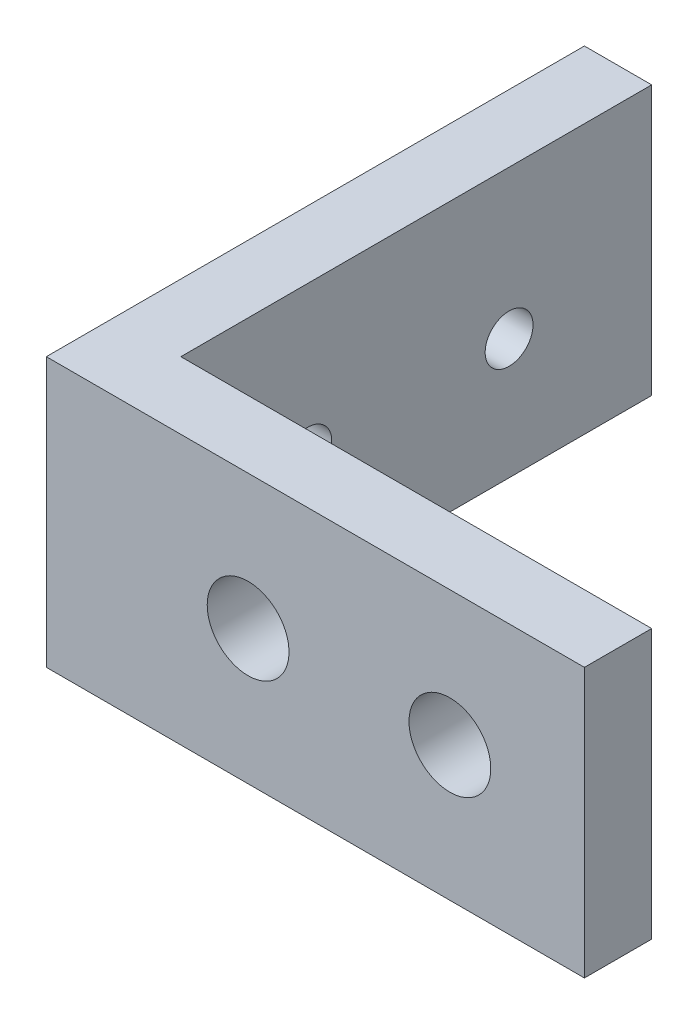
ISO-10303-21;
HEADER;
FILE_DESCRIPTION(('STEP AP214'),'2;1');
FILE_NAME('part.step','',(''),(''),'','','');
FILE_SCHEMA(('AUTOMOTIVE_DESIGN { 1 0 10303 214 1 1 1 1 }'));
ENDSEC;
DATA;
#1=APPLICATION_CONTEXT('core data for automotive mechanical design processes');
#2=APPLICATION_PROTOCOL_DEFINITION('international standard','automotive_design',2000,#1);
#3=PRODUCT_CONTEXT('',#1,'mechanical');
#4=PRODUCT('Part','Part','',(#3));
#5=PRODUCT_RELATED_PRODUCT_CATEGORY('part','',(#4));
#6=PRODUCT_DEFINITION_FORMATION('','',#4);
#7=PRODUCT_DEFINITION_CONTEXT('part definition',#1,'design');
#8=PRODUCT_DEFINITION('design','',#6,#7);
#9=PRODUCT_DEFINITION_SHAPE('','',#8);
#10=(LENGTH_UNIT() NAMED_UNIT(*) SI_UNIT(.MILLI.,.METRE.));
#11=(NAMED_UNIT(*) PLANE_ANGLE_UNIT() SI_UNIT($,.RADIAN.));
#12=(NAMED_UNIT(*) SI_UNIT($,.STERADIAN.) SOLID_ANGLE_UNIT());
#13=UNCERTAINTY_MEASURE_WITH_UNIT(LENGTH_MEASURE(1.E-05),#10,'distance_accuracy_value','');
#14=(GEOMETRIC_REPRESENTATION_CONTEXT(3) GLOBAL_UNCERTAINTY_ASSIGNED_CONTEXT((#13)) GLOBAL_UNIT_ASSIGNED_CONTEXT((#10,
#11,#12)) REPRESENTATION_CONTEXT('',''));
#15=CARTESIAN_POINT('',(0.,0.,0.));
#16=DIRECTION('',(0.,0.,1.));
#17=DIRECTION('',(1.,0.,0.));
#18=AXIS2_PLACEMENT_3D('',#15,#16,#17);
#19=CARTESIAN_POINT('',(-12.7,12.7,12.7));
#20=DIRECTION('',(1.,0.,0.));
#21=DIRECTION('',(0.,0.,-1.));
#22=AXIS2_PLACEMENT_3D('',#19,#20,#21);
#23=PLANE('',#22);
#24=CARTESIAN_POINT('',(-12.7,5.6896,-5.969));
#25=DIRECTION('',(-1.,0.,0.));
#26=DIRECTION('',(0.,0.,1.));
#27=AXIS2_PLACEMENT_3D('',#24,#25,#26);
#28=CIRCLE('',#27,1.13029999999999);
#29=CARTESIAN_POINT('',(-12.7,5.6896,-4.83870000000001));
#30=VERTEX_POINT('',#29);
#31=EDGE_CURVE('E151',#30,#30,#28,.T.);
#32=ORIENTED_EDGE('',*,*,#31,.F.);
#33=EDGE_LOOP('',(#32));
#34=FACE_BOUND('',#33,.T.);
#35=CARTESIAN_POINT('',(-12.7,5.6896,3.5306));
#36=DIRECTION('',(-1.,0.,0.));
#37=DIRECTION('',(0.,0.,1.));
#38=AXIS2_PLACEMENT_3D('',#35,#36,#37);
#39=CIRCLE('',#38,1.13029999999999);
#40=CARTESIAN_POINT('',(-12.7,5.6896,4.66089999999999));
#41=VERTEX_POINT('',#40);
#42=EDGE_CURVE('E140',#41,#41,#39,.T.);
#43=ORIENTED_EDGE('',*,*,#42,.F.);
#44=EDGE_LOOP('',(#43));
#45=FACE_BOUND('',#44,.T.);
#46=DIRECTION('',(0.,0.,1.));
#47=VECTOR('',#46,1.);
#48=CARTESIAN_POINT('',(-12.7,0.,12.7));
#49=LINE('',#48,#47);
#50=CARTESIAN_POINT('',(-12.7,0.,-12.7));
#51=VERTEX_POINT('',#50);
#52=CARTESIAN_POINT('',(-12.7,0.,12.7));
#53=VERTEX_POINT('',#52);
#54=EDGE_CURVE('E121',#51,#53,#49,.T.);
#55=ORIENTED_EDGE('',*,*,#54,.T.);
#56=DIRECTION('',(0.,-1.,0.));
#57=VECTOR('',#56,1.);
#58=CARTESIAN_POINT('',(-12.7,12.7,12.7));
#59=LINE('',#58,#57);
#60=CARTESIAN_POINT('',(-12.7,12.7,12.7));
#61=VERTEX_POINT('',#60);
#62=EDGE_CURVE('E11',#61,#53,#59,.T.);
#63=ORIENTED_EDGE('',*,*,#62,.F.);
#64=DIRECTION('',(0.,0.,1.));
#65=VECTOR('',#64,1.);
#66=CARTESIAN_POINT('',(-12.7,12.7,12.7));
#67=LINE('',#66,#65);
#68=CARTESIAN_POINT('',(-12.7,12.7,-12.7));
#69=VERTEX_POINT('',#68);
#70=EDGE_CURVE('E132',#69,#61,#67,.T.);
#71=ORIENTED_EDGE('',*,*,#70,.F.);
#72=DIRECTION('',(0.,-1.,0.));
#73=VECTOR('',#72,1.);
#74=CARTESIAN_POINT('',(-12.7,12.7,-12.7));
#75=LINE('',#74,#73);
#76=EDGE_CURVE('E117',#69,#51,#75,.T.);
#77=ORIENTED_EDGE('',*,*,#76,.T.);
#78=EDGE_LOOP('',(#55,#63,#71,#77));
#79=FACE_BOUND('',#78,.T.);
#80=ADVANCED_FACE('F35',(#34,#45,#79),#23,.F.);
#81=CARTESIAN_POINT('',(-12.7,12.7,12.7));
#82=DIRECTION('',(0.,0.,-1.));
#83=DIRECTION('',(-1.,0.,0.));
#84=AXIS2_PLACEMENT_3D('',#81,#82,#83);
#85=PLANE('',#84);
#86=CARTESIAN_POINT('',(6.35,6.35,12.7));
#87=DIRECTION('',(0.,0.,-1.));
#88=DIRECTION('',(-1.,0.,0.));
#89=AXIS2_PLACEMENT_3D('',#86,#87,#88);
#90=CIRCLE('',#89,1.9304);
#91=CARTESIAN_POINT('',(4.4196,6.35,12.7));
#92=VERTEX_POINT('',#91);
#93=EDGE_CURVE('E144',#92,#92,#90,.T.);
#94=ORIENTED_EDGE('',*,*,#93,.T.);
#95=EDGE_LOOP('',(#94));
#96=FACE_BOUND('',#95,.T.);
#97=CARTESIAN_POINT('',(-3.175,6.35,12.7));
#98=DIRECTION('',(0.,0.,-1.));
#99=DIRECTION('',(-1.,0.,0.));
#100=AXIS2_PLACEMENT_3D('',#97,#98,#99);
#101=CIRCLE('',#100,1.9304);
#102=CARTESIAN_POINT('',(-5.1054,6.35,12.7));
#103=VERTEX_POINT('',#102);
#104=EDGE_CURVE('E125',#103,#103,#101,.T.);
#105=ORIENTED_EDGE('',*,*,#104,.T.);
#106=EDGE_LOOP('',(#105));
#107=FACE_BOUND('',#106,.T.);
#108=DIRECTION('',(1.,0.,0.));
#109=VECTOR('',#108,1.);
#110=CARTESIAN_POINT('',(-12.7,0.,12.7));
#111=LINE('',#110,#109);
#112=CARTESIAN_POINT('',(12.7,0.,12.7));
#113=VERTEX_POINT('',#112);
#114=EDGE_CURVE('E124',#53,#113,#111,.T.);
#115=ORIENTED_EDGE('',*,*,#114,.T.);
#116=DIRECTION('',(0.,-1.,0.));
#117=VECTOR('',#116,1.);
#118=CARTESIAN_POINT('',(12.7,12.7,12.7));
#119=LINE('',#118,#117);
#120=CARTESIAN_POINT('',(12.7,12.7,12.7));
#121=VERTEX_POINT('',#120);
#122=EDGE_CURVE('E44',#121,#113,#119,.T.);
#123=ORIENTED_EDGE('',*,*,#122,.F.);
#124=DIRECTION('',(1.,0.,0.));
#125=VECTOR('',#124,1.);
#126=CARTESIAN_POINT('',(-12.7,12.7,12.7));
#127=LINE('',#126,#125);
#128=EDGE_CURVE('E90',#61,#121,#127,.T.);
#129=ORIENTED_EDGE('',*,*,#128,.F.);
#130=ORIENTED_EDGE('',*,*,#62,.T.);
#131=EDGE_LOOP('',(#115,#123,#129,#130));
#132=FACE_BOUND('',#131,.T.);
#133=ADVANCED_FACE('F164',(#96,#107,#132),#85,.F.);
#134=CARTESIAN_POINT('',(12.7,12.7,12.7));
#135=DIRECTION('',(-1.,0.,0.));
#136=DIRECTION('',(0.,0.,1.));
#137=AXIS2_PLACEMENT_3D('',#134,#135,#136);
#138=PLANE('',#137);
#139=DIRECTION('',(0.,0.,-1.));
#140=VECTOR('',#139,1.);
#141=CARTESIAN_POINT('',(12.7,0.,12.7));
#142=LINE('',#141,#140);
#143=CARTESIAN_POINT('',(12.7,0.,9.525));
#144=VERTEX_POINT('',#143);
#145=EDGE_CURVE('E127',#113,#144,#142,.T.);
#146=ORIENTED_EDGE('',*,*,#145,.T.);
#147=DIRECTION('',(0.,-1.,0.));
#148=VECTOR('',#147,1.);
#149=CARTESIAN_POINT('',(12.7,12.7,9.525));
#150=LINE('',#149,#148);
#151=CARTESIAN_POINT('',(12.7,12.7,9.525));
#152=VERTEX_POINT('',#151);
#153=EDGE_CURVE('E112',#152,#144,#150,.T.);
#154=ORIENTED_EDGE('',*,*,#153,.F.);
#155=DIRECTION('',(0.,0.,-1.));
#156=VECTOR('',#155,1.);
#157=CARTESIAN_POINT('',(12.7,12.7,12.7));
#158=LINE('',#157,#156);
#159=EDGE_CURVE('E103',#121,#152,#158,.T.);
#160=ORIENTED_EDGE('',*,*,#159,.F.);
#161=ORIENTED_EDGE('',*,*,#122,.T.);
#162=EDGE_LOOP('',(#146,#154,#160,#161));
#163=FACE_BOUND('',#162,.T.);
#164=ADVANCED_FACE('F167',(#163),#138,.F.);
#165=CARTESIAN_POINT('',(-9.525,12.7,9.525));
#166=DIRECTION('',(0.,0.,1.));
#167=DIRECTION('',(1.,0.,0.));
#168=AXIS2_PLACEMENT_3D('',#165,#166,#167);
#169=PLANE('',#168);
#170=CARTESIAN_POINT('',(6.35,6.35,9.525));
#171=DIRECTION('',(0.,0.,-1.));
#172=DIRECTION('',(-1.,0.,0.));
#173=AXIS2_PLACEMENT_3D('',#170,#171,#172);
#174=CIRCLE('',#173,1.9304);
#175=CARTESIAN_POINT('',(4.4196,6.35,9.525));
#176=VERTEX_POINT('',#175);
#177=EDGE_CURVE('E139',#176,#176,#174,.T.);
#178=ORIENTED_EDGE('',*,*,#177,.F.);
#179=EDGE_LOOP('',(#178));
#180=FACE_BOUND('',#179,.T.);
#181=CARTESIAN_POINT('',(-3.175,6.35,9.525));
#182=DIRECTION('',(0.,0.,-1.));
#183=DIRECTION('',(-1.,0.,0.));
#184=AXIS2_PLACEMENT_3D('',#181,#182,#183);
#185=CIRCLE('',#184,1.9304);
#186=CARTESIAN_POINT('',(-5.1054,6.35,9.525));
#187=VERTEX_POINT('',#186);
#188=EDGE_CURVE('E156',#187,#187,#185,.T.);
#189=ORIENTED_EDGE('',*,*,#188,.F.);
#190=EDGE_LOOP('',(#189));
#191=FACE_BOUND('',#190,.T.);
#192=DIRECTION('',(-1.,0.,0.));
#193=VECTOR('',#192,1.);
#194=CARTESIAN_POINT('',(-9.525,0.,9.525));
#195=LINE('',#194,#193);
#196=CARTESIAN_POINT('',(-9.525,0.,9.525));
#197=VERTEX_POINT('',#196);
#198=EDGE_CURVE('E111',#144,#197,#195,.T.);
#199=ORIENTED_EDGE('',*,*,#198,.T.);
#200=DIRECTION('',(0.,-1.,0.));
#201=VECTOR('',#200,1.);
#202=CARTESIAN_POINT('',(-9.525,12.7,9.525));
#203=LINE('',#202,#201);
#204=CARTESIAN_POINT('',(-9.525,12.7,9.525));
#205=VERTEX_POINT('',#204);
#206=EDGE_CURVE('E108',#205,#197,#203,.T.);
#207=ORIENTED_EDGE('',*,*,#206,.F.);
#208=DIRECTION('',(-1.,0.,0.));
#209=VECTOR('',#208,1.);
#210=CARTESIAN_POINT('',(-9.525,12.7,9.525));
#211=LINE('',#210,#209);
#212=EDGE_CURVE('E97',#152,#205,#211,.T.);
#213=ORIENTED_EDGE('',*,*,#212,.F.);
#214=ORIENTED_EDGE('',*,*,#153,.T.);
#215=EDGE_LOOP('',(#199,#207,#213,#214));
#216=FACE_BOUND('',#215,.T.);
#217=ADVANCED_FACE('F109',(#180,#191,#216),#169,.F.);
#218=CARTESIAN_POINT('',(-9.525,12.7,-12.7));
#219=DIRECTION('',(-1.,0.,0.));
#220=DIRECTION('',(0.,0.,1.));
#221=AXIS2_PLACEMENT_3D('',#218,#219,#220);
#222=PLANE('',#221);
#223=CARTESIAN_POINT('',(-9.525,5.6896,-5.969));
#224=DIRECTION('',(-1.,0.,0.));
#225=DIRECTION('',(0.,0.,1.));
#226=AXIS2_PLACEMENT_3D('',#223,#224,#225);
#227=CIRCLE('',#226,1.13029999999999);
#228=CARTESIAN_POINT('',(-9.525,5.6896,-4.8387));
#229=VERTEX_POINT('',#228);
#230=EDGE_CURVE('E38',#229,#229,#227,.T.);
#231=ORIENTED_EDGE('',*,*,#230,.T.);
#232=EDGE_LOOP('',(#231));
#233=FACE_BOUND('',#232,.T.);
#234=CARTESIAN_POINT('',(-9.525,5.6896,3.5306));
#235=DIRECTION('',(-1.,0.,0.));
#236=DIRECTION('',(0.,0.,1.));
#237=AXIS2_PLACEMENT_3D('',#234,#235,#236);
#238=CIRCLE('',#237,1.13029999999999);
#239=CARTESIAN_POINT('',(-9.525,5.6896,4.6609));
#240=VERTEX_POINT('',#239);
#241=EDGE_CURVE('E137',#240,#240,#238,.T.);
#242=ORIENTED_EDGE('',*,*,#241,.T.);
#243=EDGE_LOOP('',(#242));
#244=FACE_BOUND('',#243,.T.);
#245=DIRECTION('',(0.,0.,-1.));
#246=VECTOR('',#245,1.);
#247=CARTESIAN_POINT('',(-9.525,0.,-12.7));
#248=LINE('',#247,#246);
#249=CARTESIAN_POINT('',(-9.525,0.,-12.7));
#250=VERTEX_POINT('',#249);
#251=EDGE_CURVE('E76',#197,#250,#248,.T.);
#252=ORIENTED_EDGE('',*,*,#251,.T.);
#253=DIRECTION('',(0.,-1.,0.));
#254=VECTOR('',#253,1.);
#255=CARTESIAN_POINT('',(-9.525,12.7,-12.7));
#256=LINE('',#255,#254);
#257=CARTESIAN_POINT('',(-9.525,12.7,-12.7));
#258=VERTEX_POINT('',#257);
#259=EDGE_CURVE('E113',#258,#250,#256,.T.);
#260=ORIENTED_EDGE('',*,*,#259,.F.);
#261=DIRECTION('',(0.,0.,-1.));
#262=VECTOR('',#261,1.);
#263=CARTESIAN_POINT('',(-9.525,12.7,-12.7));
#264=LINE('',#263,#262);
#265=EDGE_CURVE('E101',#205,#258,#264,.T.);
#266=ORIENTED_EDGE('',*,*,#265,.F.);
#267=ORIENTED_EDGE('',*,*,#206,.T.);
#268=EDGE_LOOP('',(#252,#260,#266,#267));
#269=FACE_BOUND('',#268,.T.);
#270=ADVANCED_FACE('F115',(#233,#244,#269),#222,.F.);
#271=CARTESIAN_POINT('',(-12.7,12.7,-12.7));
#272=DIRECTION('',(0.,0.,1.));
#273=DIRECTION('',(1.,0.,0.));
#274=AXIS2_PLACEMENT_3D('',#271,#272,#273);
#275=PLANE('',#274);
#276=DIRECTION('',(-1.,0.,0.));
#277=VECTOR('',#276,1.);
#278=CARTESIAN_POINT('',(-12.7,0.,-12.7));
#279=LINE('',#278,#277);
#280=EDGE_CURVE('E82',#250,#51,#279,.T.);
#281=ORIENTED_EDGE('',*,*,#280,.T.);
#282=ORIENTED_EDGE('',*,*,#76,.F.);
#283=DIRECTION('',(-1.,0.,0.));
#284=VECTOR('',#283,1.);
#285=CARTESIAN_POINT('',(-12.7,12.7,-12.7));
#286=LINE('',#285,#284);
#287=EDGE_CURVE('E53',#258,#69,#286,.T.);
#288=ORIENTED_EDGE('',*,*,#287,.F.);
#289=ORIENTED_EDGE('',*,*,#259,.T.);
#290=EDGE_LOOP('',(#281,#282,#288,#289));
#291=FACE_BOUND('',#290,.T.);
#292=ADVANCED_FACE('F172',(#291),#275,.F.);
#293=CARTESIAN_POINT('',(0.,12.7,0.));
#294=DIRECTION('',(0.,-1.,0.));
#295=DIRECTION('',(0.,0.,-1.));
#296=AXIS2_PLACEMENT_3D('',#293,#294,#295);
#297=PLANE('',#296);
#298=ORIENTED_EDGE('',*,*,#70,.T.);
#299=ORIENTED_EDGE('',*,*,#128,.T.);
#300=ORIENTED_EDGE('',*,*,#159,.T.);
#301=ORIENTED_EDGE('',*,*,#212,.T.);
#302=ORIENTED_EDGE('',*,*,#265,.T.);
#303=ORIENTED_EDGE('',*,*,#287,.T.);
#304=EDGE_LOOP('',(#298,#299,#300,#301,#302,#303));
#305=FACE_BOUND('',#304,.T.);
#306=ADVANCED_FACE('F99',(#305),#297,.F.);
#307=CARTESIAN_POINT('',(0.,0.,0.));
#308=DIRECTION('',(0.,-1.,0.));
#309=DIRECTION('',(0.,0.,-1.));
#310=AXIS2_PLACEMENT_3D('',#307,#308,#309);
#311=PLANE('',#310);
#312=ORIENTED_EDGE('',*,*,#54,.F.);
#313=ORIENTED_EDGE('',*,*,#280,.F.);
#314=ORIENTED_EDGE('',*,*,#251,.F.);
#315=ORIENTED_EDGE('',*,*,#198,.F.);
#316=ORIENTED_EDGE('',*,*,#145,.F.);
#317=ORIENTED_EDGE('',*,*,#114,.F.);
#318=EDGE_LOOP('',(#312,#313,#314,#315,#316,#317));
#319=FACE_BOUND('',#318,.T.);
#320=ADVANCED_FACE('F170',(#319),#311,.T.);
#321=CARTESIAN_POINT('',(-3.175,6.35,9.525));
#322=DIRECTION('',(0.,0.,-1.));
#323=DIRECTION('',(-1.,0.,0.));
#324=AXIS2_PLACEMENT_3D('',#321,#322,#323);
#325=CYLINDRICAL_SURFACE('',#324,1.9304);
#326=ORIENTED_EDGE('',*,*,#104,.F.);
#327=EDGE_LOOP('',(#326));
#328=FACE_BOUND('',#327,.T.);
#329=ORIENTED_EDGE('',*,*,#188,.T.);
#330=EDGE_LOOP('',(#329));
#331=FACE_BOUND('',#330,.T.);
#332=ADVANCED_FACE('F207',(#328,#331),#325,.F.);
#333=CARTESIAN_POINT('',(6.35,6.35,9.525));
#334=DIRECTION('',(0.,0.,-1.));
#335=DIRECTION('',(-1.,0.,0.));
#336=AXIS2_PLACEMENT_3D('',#333,#334,#335);
#337=CYLINDRICAL_SURFACE('',#336,1.9304);
#338=ORIENTED_EDGE('',*,*,#93,.F.);
#339=EDGE_LOOP('',(#338));
#340=FACE_BOUND('',#339,.T.);
#341=ORIENTED_EDGE('',*,*,#177,.T.);
#342=EDGE_LOOP('',(#341));
#343=FACE_BOUND('',#342,.T.);
#344=ADVANCED_FACE('F202',(#340,#343),#337,.F.);
#345=CARTESIAN_POINT('',(-12.7,5.6896,3.5306));
#346=DIRECTION('',(-1.,0.,0.));
#347=DIRECTION('',(0.,0.,1.));
#348=AXIS2_PLACEMENT_3D('',#345,#346,#347);
#349=CYLINDRICAL_SURFACE('',#348,1.13029999999999);
#350=ORIENTED_EDGE('',*,*,#42,.T.);
#351=EDGE_LOOP('',(#350));
#352=FACE_BOUND('',#351,.T.);
#353=ORIENTED_EDGE('',*,*,#241,.F.);
#354=EDGE_LOOP('',(#353));
#355=FACE_BOUND('',#354,.T.);
#356=ADVANCED_FACE('F196',(#352,#355),#349,.F.);
#357=CARTESIAN_POINT('',(-12.7,5.6896,-5.969));
#358=DIRECTION('',(-1.,0.,0.));
#359=DIRECTION('',(0.,0.,1.));
#360=AXIS2_PLACEMENT_3D('',#357,#358,#359);
#361=CYLINDRICAL_SURFACE('',#360,1.13029999999999);
#362=ORIENTED_EDGE('',*,*,#31,.T.);
#363=EDGE_LOOP('',(#362));
#364=FACE_BOUND('',#363,.T.);
#365=ORIENTED_EDGE('',*,*,#230,.F.);
#366=EDGE_LOOP('',(#365));
#367=FACE_BOUND('',#366,.T.);
#368=ADVANCED_FACE('F193',(#364,#367),#361,.F.);
#369=CLOSED_SHELL('',(#80,#133,#164,#217,#270,#292,#306,#320,#332,#344,#356,#368));
#370=MANIFOLD_SOLID_BREP('B2',#369);
#371=ADVANCED_BREP_SHAPE_REPRESENTATION('',(#18,#370),#14);
#372=SHAPE_DEFINITION_REPRESENTATION(#9,#371);
ENDSEC;
END-ISO-10303-21;
